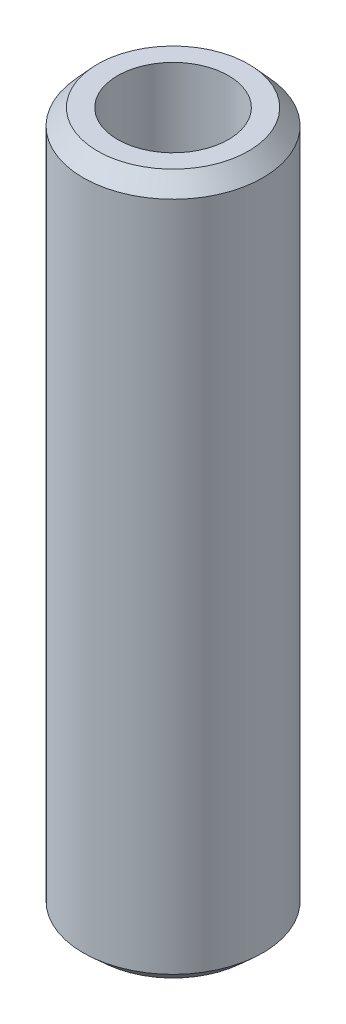
ISO-10303-21;
HEADER;
FILE_DESCRIPTION(('STEP AP214'),'2;1');
FILE_NAME('part.step','',(''),(''),'','','');
FILE_SCHEMA(('AUTOMOTIVE_DESIGN { 1 0 10303 214 1 1 1 1 }'));
ENDSEC;
DATA;
#1=APPLICATION_CONTEXT('core data for automotive mechanical design processes');
#2=APPLICATION_PROTOCOL_DEFINITION('international standard','automotive_design',2000,#1);
#3=PRODUCT_CONTEXT('',#1,'mechanical');
#4=PRODUCT('Part','Part','',(#3));
#5=PRODUCT_RELATED_PRODUCT_CATEGORY('part','',(#4));
#6=PRODUCT_DEFINITION_FORMATION('','',#4);
#7=PRODUCT_DEFINITION_CONTEXT('part definition',#1,'design');
#8=PRODUCT_DEFINITION('design','',#6,#7);
#9=PRODUCT_DEFINITION_SHAPE('','',#8);
#10=(LENGTH_UNIT() NAMED_UNIT(*) SI_UNIT(.MILLI.,.METRE.));
#11=(NAMED_UNIT(*) PLANE_ANGLE_UNIT() SI_UNIT($,.RADIAN.));
#12=(NAMED_UNIT(*) SI_UNIT($,.STERADIAN.) SOLID_ANGLE_UNIT());
#13=UNCERTAINTY_MEASURE_WITH_UNIT(LENGTH_MEASURE(1.E-05),#10,'distance_accuracy_value','');
#14=(GEOMETRIC_REPRESENTATION_CONTEXT(3) GLOBAL_UNCERTAINTY_ASSIGNED_CONTEXT((#13)) GLOBAL_UNIT_ASSIGNED_CONTEXT((#10,
#11,#12)) REPRESENTATION_CONTEXT('',''));
#15=CARTESIAN_POINT('',(0.,0.,0.));
#16=DIRECTION('',(0.,0.,1.));
#17=DIRECTION('',(1.,0.,0.));
#18=AXIS2_PLACEMENT_3D('',#15,#16,#17);
#19=CARTESIAN_POINT('',(0.,156.18046980717,0.));
#20=DIRECTION('',(0.,-1.,0.));
#21=DIRECTION('',(0.,0.,-1.));
#22=AXIS2_PLACEMENT_3D('',#19,#20,#21);
#23=CYLINDRICAL_SURFACE('',#22,20.);
#24=CARTESIAN_POINT('',(0.,152.644051062612,0.));
#25=DIRECTION('',(0.,1.,0.));
#26=DIRECTION('',(0.,0.,1.));
#27=AXIS2_PLACEMENT_3D('',#24,#25,#26);
#28=CIRCLE('',#27,20.);
#29=CARTESIAN_POINT('',(0.,152.644051062612,20.));
#30=VERTEX_POINT('',#29);
#31=EDGE_CURVE('E50',#30,#30,#28,.F.);
#32=ORIENTED_EDGE('',*,*,#31,.T.);
#33=EDGE_LOOP('',(#32));
#34=FACE_BOUND('',#33,.T.);
#35=CARTESIAN_POINT('',(0.,3.20508934811398,0.));
#36=DIRECTION('',(0.,1.,0.));
#37=DIRECTION('',(0.,0.,1.));
#38=AXIS2_PLACEMENT_3D('',#35,#36,#37);
#39=CIRCLE('',#38,20.);
#40=CARTESIAN_POINT('',(0.,3.20508934811398,20.));
#41=VERTEX_POINT('',#40);
#42=EDGE_CURVE('E51',#41,#41,#39,.T.);
#43=ORIENTED_EDGE('',*,*,#42,.T.);
#44=EDGE_LOOP('',(#43));
#45=FACE_BOUND('',#44,.T.);
#46=ADVANCED_FACE('F39',(#34,#45),#23,.T.);
#47=CARTESIAN_POINT('',(0.,156.18046980717,0.));
#48=DIRECTION('',(0.,1.,0.));
#49=DIRECTION('',(0.,0.,1.));
#50=AXIS2_PLACEMENT_3D('',#47,#48,#49);
#51=PLANE('',#50);
#52=CARTESIAN_POINT('',(0.,156.18046980717,0.));
#53=DIRECTION('',(0.,1.,0.));
#54=DIRECTION('',(0.,0.,1.));
#55=AXIS2_PLACEMENT_3D('',#52,#53,#54);
#56=CIRCLE('',#55,16.7949106518861);
#57=CARTESIAN_POINT('',(0.,156.18046980717,16.7949106518861));
#58=VERTEX_POINT('',#57);
#59=EDGE_CURVE('E54',#58,#58,#56,.T.);
#60=ORIENTED_EDGE('',*,*,#59,.T.);
#61=EDGE_LOOP('',(#60));
#62=FACE_BOUND('',#61,.T.);
#63=CARTESIAN_POINT('',(0.,156.18046980717,0.));
#64=DIRECTION('',(0.,1.,0.));
#65=DIRECTION('',(0.,0.,1.));
#66=AXIS2_PLACEMENT_3D('',#63,#64,#65);
#67=CIRCLE('',#66,12.3340200871929);
#68=CARTESIAN_POINT('',(0.,156.18046980717,12.3340200871929));
#69=VERTEX_POINT('',#68);
#70=EDGE_CURVE('E58',#69,#69,#67,.T.);
#71=ORIENTED_EDGE('',*,*,#70,.F.);
#72=EDGE_LOOP('',(#71));
#73=FACE_BOUND('',#72,.T.);
#74=ADVANCED_FACE('F69',(#62,#73),#51,.T.);
#75=CARTESIAN_POINT('',(0.,0.,0.));
#76=DIRECTION('',(0.,1.,0.));
#77=DIRECTION('',(0.,0.,1.));
#78=AXIS2_PLACEMENT_3D('',#75,#76,#77);
#79=PLANE('',#78);
#80=CARTESIAN_POINT('',(0.,0.,0.));
#81=DIRECTION('',(0.,1.,0.));
#82=DIRECTION('',(0.,0.,1.));
#83=AXIS2_PLACEMENT_3D('',#80,#81,#82);
#84=CIRCLE('',#83,16.4635812554423);
#85=CARTESIAN_POINT('',(0.,0.,16.4635812554423));
#86=VERTEX_POINT('',#85);
#87=EDGE_CURVE('E10',#86,#86,#84,.F.);
#88=ORIENTED_EDGE('',*,*,#87,.T.);
#89=EDGE_LOOP('',(#88));
#90=FACE_BOUND('',#89,.T.);
#91=CARTESIAN_POINT('',(0.,0.,0.));
#92=DIRECTION('',(0.,1.,0.));
#93=DIRECTION('',(0.,0.,1.));
#94=AXIS2_PLACEMENT_3D('',#91,#92,#93);
#95=CIRCLE('',#94,12.3340200871929);
#96=CARTESIAN_POINT('',(0.,0.,12.3340200871929));
#97=VERTEX_POINT('',#96);
#98=EDGE_CURVE('E63',#97,#97,#95,.T.);
#99=ORIENTED_EDGE('',*,*,#98,.T.);
#100=EDGE_LOOP('',(#99));
#101=FACE_BOUND('',#100,.T.);
#102=ADVANCED_FACE('F75',(#90,#101),#79,.F.);
#103=CARTESIAN_POINT('',(0.,156.18046980717,0.));
#104=DIRECTION('',(0.,-1.,0.));
#105=DIRECTION('',(0.,0.,-1.));
#106=AXIS2_PLACEMENT_3D('',#103,#104,#105);
#107=CYLINDRICAL_SURFACE('',#106,12.3340200871929);
#108=ORIENTED_EDGE('',*,*,#70,.T.);
#109=EDGE_LOOP('',(#108));
#110=FACE_BOUND('',#109,.T.);
#111=ORIENTED_EDGE('',*,*,#98,.F.);
#112=EDGE_LOOP('',(#111));
#113=FACE_BOUND('',#112,.T.);
#114=ADVANCED_FACE('F70',(#110,#113),#107,.F.);
#115=CARTESIAN_POINT('',(0.,156.18046980717,0.));
#116=DIRECTION('',(0.,-1.,0.));
#117=DIRECTION('',(0.,0.,-1.));
#118=AXIS2_PLACEMENT_3D('',#115,#116,#117);
#119=CONICAL_SURFACE('',#118,16.7949106518861,0.736290010855284);
#120=ORIENTED_EDGE('',*,*,#31,.F.);
#121=EDGE_LOOP('',(#120));
#122=FACE_BOUND('',#121,.T.);
#123=ORIENTED_EDGE('',*,*,#59,.F.);
#124=EDGE_LOOP('',(#123));
#125=FACE_BOUND('',#124,.T.);
#126=ADVANCED_FACE('F81',(#122,#125),#119,.T.);
#127=CARTESIAN_POINT('',(0.,3.20508934811398,0.));
#128=DIRECTION('',(0.,1.,0.));
#129=DIRECTION('',(0.,0.,1.));
#130=AXIS2_PLACEMENT_3D('',#127,#128,#129);
#131=CONICAL_SURFACE('',#130,20.,0.834506315939613);
#132=ORIENTED_EDGE('',*,*,#87,.F.);
#133=EDGE_LOOP('',(#132));
#134=FACE_BOUND('',#133,.T.);
#135=ORIENTED_EDGE('',*,*,#42,.F.);
#136=EDGE_LOOP('',(#135));
#137=FACE_BOUND('',#136,.T.);
#138=ADVANCED_FACE('F45',(#134,#137),#131,.T.);
#139=CLOSED_SHELL('',(#46,#74,#102,#114,#126,#138));
#140=MANIFOLD_SOLID_BREP('B2',#139);
#141=ADVANCED_BREP_SHAPE_REPRESENTATION('',(#18,#140),#14);
#142=SHAPE_DEFINITION_REPRESENTATION(#9,#141);
ENDSEC;
END-ISO-10303-21;
